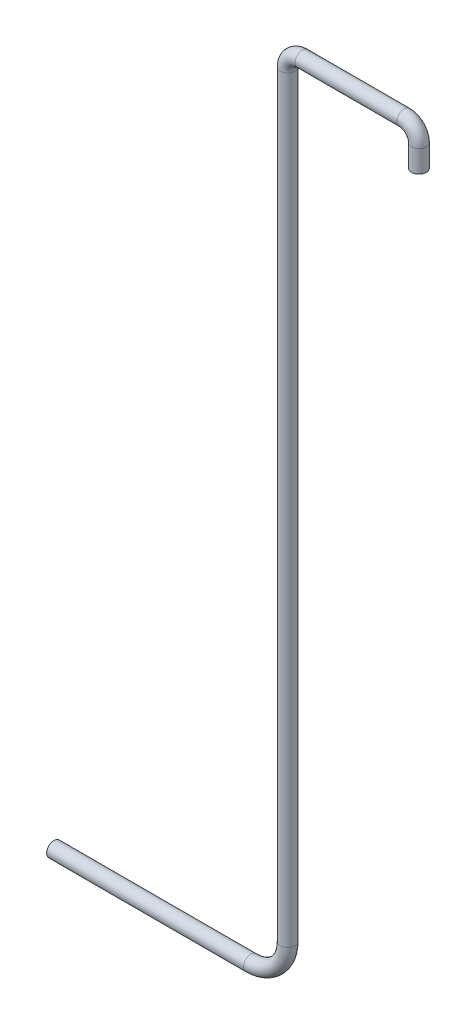
ISO-10303-21;
HEADER;
FILE_DESCRIPTION(('STEP AP214'),'2;1');
FILE_NAME('part.step','',(''),(''),'','','');
FILE_SCHEMA(('AUTOMOTIVE_DESIGN { 1 0 10303 214 1 1 1 1 }'));
ENDSEC;
DATA;
#1=APPLICATION_CONTEXT('core data for automotive mechanical design processes');
#2=APPLICATION_PROTOCOL_DEFINITION('international standard','automotive_design',2000,#1);
#3=PRODUCT_CONTEXT('',#1,'mechanical');
#4=PRODUCT('Part','Part','',(#3));
#5=PRODUCT_RELATED_PRODUCT_CATEGORY('part','',(#4));
#6=PRODUCT_DEFINITION_FORMATION('','',#4);
#7=PRODUCT_DEFINITION_CONTEXT('part definition',#1,'design');
#8=PRODUCT_DEFINITION('design','',#6,#7);
#9=PRODUCT_DEFINITION_SHAPE('','',#8);
#10=(LENGTH_UNIT() NAMED_UNIT(*) SI_UNIT(.MILLI.,.METRE.));
#11=(NAMED_UNIT(*) PLANE_ANGLE_UNIT() SI_UNIT($,.RADIAN.));
#12=(NAMED_UNIT(*) SI_UNIT($,.STERADIAN.) SOLID_ANGLE_UNIT());
#13=UNCERTAINTY_MEASURE_WITH_UNIT(LENGTH_MEASURE(1.E-05),#10,'distance_accuracy_value','');
#14=(GEOMETRIC_REPRESENTATION_CONTEXT(3) GLOBAL_UNCERTAINTY_ASSIGNED_CONTEXT((#13)) GLOBAL_UNIT_ASSIGNED_CONTEXT((#10,
#11,#12)) REPRESENTATION_CONTEXT('',''));
#15=CARTESIAN_POINT('',(0.,0.,0.));
#16=DIRECTION('',(0.,0.,1.));
#17=DIRECTION('',(1.,0.,0.));
#18=AXIS2_PLACEMENT_3D('',#15,#16,#17);
#19=CARTESIAN_POINT('',(-2.28453374132914,-10.4924306069734,0.));
#20=DIRECTION('',(-1.,0.,0.));
#21=DIRECTION('',(0.,0.,1.));
#22=AXIS2_PLACEMENT_3D('',#19,#20,#21);
#23=CYLINDRICAL_SURFACE('',#22,0.1);
#24=CARTESIAN_POINT('',(-2.28453374132914,-10.4924306069734,0.));
#25=DIRECTION('',(-1.,0.,0.));
#26=DIRECTION('',(0.,0.,1.));
#27=AXIS2_PLACEMENT_3D('',#24,#25,#26);
#28=CIRCLE('',#27,0.1);
#29=CARTESIAN_POINT('',(-2.28453374132914,-10.5924306069734,0.));
#30=VERTEX_POINT('',#29);
#31=EDGE_CURVE('E34',#30,#30,#28,.T.);
#32=ORIENTED_EDGE('',*,*,#31,.T.);
#33=EDGE_LOOP('',(#32));
#34=FACE_BOUND('',#33,.T.);
#35=CARTESIAN_POINT('',(-4.96020057499891,-10.4924306069734,0.));
#36=DIRECTION('',(-1.,0.,0.));
#37=DIRECTION('',(0.,0.,1.));
#38=AXIS2_PLACEMENT_3D('',#35,#36,#37);
#39=CIRCLE('',#38,0.1);
#40=CARTESIAN_POINT('',(-4.96020057499891,-10.4924306069734,0.1));
#41=VERTEX_POINT('',#40);
#42=EDGE_CURVE('E10',#41,#41,#39,.T.);
#43=ORIENTED_EDGE('',*,*,#42,.F.);
#44=EDGE_LOOP('',(#43));
#45=FACE_BOUND('',#44,.T.);
#46=ADVANCED_FACE('F28',(#34,#45),#23,.T.);
#47=CARTESIAN_POINT('',(-2.28453374132914,-9.99243060697336,0.));
#48=DIRECTION('',(0.,0.,-1.));
#49=DIRECTION('',(-1.,0.,0.));
#50=AXIS2_PLACEMENT_3D('',#47,#48,#49);
#51=TOROIDAL_SURFACE('',#50,0.5,0.1);
#52=CARTESIAN_POINT('',(-1.78453374132914,-9.99243060697336,0.));
#53=DIRECTION('',(0.,-1.,0.));
#54=DIRECTION('',(0.,0.,1.));
#55=AXIS2_PLACEMENT_3D('',#52,#53,#54);
#56=CIRCLE('',#55,0.1);
#57=CARTESIAN_POINT('',(-1.68453374132914,-9.99243060697336,0.));
#58=VERTEX_POINT('',#57);
#59=EDGE_CURVE('E38',#58,#58,#56,.T.);
#60=CARTESIAN_POINT('',(-2.28453374132914,-9.99243060697336,0.));
#61=DIRECTION('',(0.,0.,-1.));
#62=DIRECTION('',(-1.,0.,0.));
#63=AXIS2_PLACEMENT_3D('',#60,#61,#62);
#64=CIRCLE('',#63,0.6);
#65=EDGE_CURVE('',#58,#30,#64,.T.);
#66=ORIENTED_EDGE('',*,*,#59,.T.);
#67=ORIENTED_EDGE('',*,*,#31,.F.);
#68=ORIENTED_EDGE('',*,*,#65,.T.);
#69=ORIENTED_EDGE('',*,*,#65,.F.);
#70=EDGE_LOOP('',(#66,#68,#67,#69));
#71=FACE_BOUND('',#70,.T.);
#72=ADVANCED_FACE('F78',(#71),#51,.T.);
#73=CARTESIAN_POINT('',(-1.78453374132914,0.3,0.));
#74=DIRECTION('',(0.,-1.,0.));
#75=DIRECTION('',(0.,0.,-1.));
#76=AXIS2_PLACEMENT_3D('',#73,#74,#75);
#77=CYLINDRICAL_SURFACE('',#76,0.1);
#78=CARTESIAN_POINT('',(-1.78453374132914,0.3,0.));
#79=DIRECTION('',(0.,-1.,0.));
#80=DIRECTION('',(0.,0.,1.));
#81=AXIS2_PLACEMENT_3D('',#78,#79,#80);
#82=CIRCLE('',#81,0.1);
#83=CARTESIAN_POINT('',(-1.88453374132914,0.3,0.));
#84=VERTEX_POINT('',#83);
#85=EDGE_CURVE('E42',#84,#84,#82,.T.);
#86=ORIENTED_EDGE('',*,*,#85,.T.);
#87=EDGE_LOOP('',(#86));
#88=FACE_BOUND('',#87,.T.);
#89=ORIENTED_EDGE('',*,*,#59,.F.);
#90=EDGE_LOOP('',(#89));
#91=FACE_BOUND('',#90,.T.);
#92=ADVANCED_FACE('F82',(#88,#91),#77,.T.);
#93=CARTESIAN_POINT('',(-1.58453374132914,0.3,0.));
#94=DIRECTION('',(0.,0.,1.));
#95=DIRECTION('',(1.,0.,0.));
#96=AXIS2_PLACEMENT_3D('',#93,#94,#95);
#97=TOROIDAL_SURFACE('',#96,0.2,0.1);
#98=CARTESIAN_POINT('',(-1.58453374132914,0.5,0.));
#99=DIRECTION('',(-1.,0.,0.));
#100=DIRECTION('',(0.,0.,1.));
#101=AXIS2_PLACEMENT_3D('',#98,#99,#100);
#102=CIRCLE('',#101,0.1);
#103=CARTESIAN_POINT('',(-1.58453374132914,0.6,0.));
#104=VERTEX_POINT('',#103);
#105=EDGE_CURVE('E47',#104,#104,#102,.T.);
#106=CARTESIAN_POINT('',(-1.58453374132914,0.3,0.));
#107=DIRECTION('',(0.,0.,1.));
#108=DIRECTION('',(1.,0.,0.));
#109=AXIS2_PLACEMENT_3D('',#106,#107,#108);
#110=CIRCLE('',#109,0.3);
#111=EDGE_CURVE('',#104,#84,#110,.T.);
#112=ORIENTED_EDGE('',*,*,#105,.T.);
#113=ORIENTED_EDGE('',*,*,#85,.F.);
#114=ORIENTED_EDGE('',*,*,#111,.T.);
#115=ORIENTED_EDGE('',*,*,#111,.F.);
#116=EDGE_LOOP('',(#112,#114,#113,#115));
#117=FACE_BOUND('',#116,.T.);
#118=ADVANCED_FACE('F88',(#117),#97,.T.);
#119=CARTESIAN_POINT('',(-0.200000000000001,0.5,0.));
#120=DIRECTION('',(-1.,0.,0.));
#121=DIRECTION('',(0.,-1.,0.));
#122=AXIS2_PLACEMENT_3D('',#119,#120,#121);
#123=CYLINDRICAL_SURFACE('',#122,0.1);
#124=CARTESIAN_POINT('',(-0.200000000000001,0.5,0.));
#125=DIRECTION('',(-1.,0.,0.));
#126=DIRECTION('',(0.,0.,1.));
#127=AXIS2_PLACEMENT_3D('',#124,#125,#126);
#128=CIRCLE('',#127,0.1);
#129=CARTESIAN_POINT('',(-0.200000000000002,0.6,0.));
#130=VERTEX_POINT('',#129);
#131=EDGE_CURVE('E50',#130,#130,#128,.T.);
#132=ORIENTED_EDGE('',*,*,#131,.T.);
#133=EDGE_LOOP('',(#132));
#134=FACE_BOUND('',#133,.T.);
#135=ORIENTED_EDGE('',*,*,#105,.F.);
#136=EDGE_LOOP('',(#135));
#137=FACE_BOUND('',#136,.T.);
#138=ADVANCED_FACE('F95',(#134,#137),#123,.T.);
#139=CARTESIAN_POINT('',(-0.2,0.3,0.));
#140=DIRECTION('',(0.,0.,1.));
#141=DIRECTION('',(1.,0.,0.));
#142=AXIS2_PLACEMENT_3D('',#139,#140,#141);
#143=TOROIDAL_SURFACE('',#142,0.2,0.1);
#144=CARTESIAN_POINT('',(0.,0.299999999999999,0.));
#145=DIRECTION('',(0.,1.,0.));
#146=DIRECTION('',(0.,0.,1.));
#147=AXIS2_PLACEMENT_3D('',#144,#145,#146);
#148=CIRCLE('',#147,0.1);
#149=CARTESIAN_POINT('',(0.1,0.299999999999998,0.));
#150=VERTEX_POINT('',#149);
#151=EDGE_CURVE('E53',#150,#150,#148,.T.);
#152=CARTESIAN_POINT('',(-0.2,0.3,0.));
#153=DIRECTION('',(0.,0.,1.));
#154=DIRECTION('',(1.,0.,0.));
#155=AXIS2_PLACEMENT_3D('',#152,#153,#154);
#156=CIRCLE('',#155,0.3);
#157=EDGE_CURVE('',#150,#130,#156,.T.);
#158=ORIENTED_EDGE('',*,*,#151,.T.);
#159=ORIENTED_EDGE('',*,*,#131,.F.);
#160=ORIENTED_EDGE('',*,*,#157,.T.);
#161=ORIENTED_EDGE('',*,*,#157,.F.);
#162=EDGE_LOOP('',(#158,#160,#159,#161));
#163=FACE_BOUND('',#162,.T.);
#164=ADVANCED_FACE('F60',(#163),#143,.T.);
#165=CARTESIAN_POINT('',(0.,0.299999999999999,0.));
#166=DIRECTION('',(0.,-1.,0.));
#167=DIRECTION('',(0.,0.,-1.));
#168=AXIS2_PLACEMENT_3D('',#165,#166,#167);
#169=CYLINDRICAL_SURFACE('',#168,0.1);
#170=ORIENTED_EDGE('',*,*,#151,.F.);
#171=EDGE_LOOP('',(#170));
#172=FACE_BOUND('',#171,.T.);
#173=CARTESIAN_POINT('',(0.,0.,0.));
#174=DIRECTION('',(0.,1.,0.));
#175=DIRECTION('',(0.,0.,1.));
#176=AXIS2_PLACEMENT_3D('',#173,#174,#175);
#177=CIRCLE('',#176,0.1);
#178=CARTESIAN_POINT('',(0.,0.,0.1));
#179=VERTEX_POINT('',#178);
#180=EDGE_CURVE('E54',#179,#179,#177,.T.);
#181=ORIENTED_EDGE('',*,*,#180,.T.);
#182=EDGE_LOOP('',(#181));
#183=FACE_BOUND('',#182,.T.);
#184=ADVANCED_FACE('F63',(#172,#183),#169,.T.);
#185=CARTESIAN_POINT('',(-4.96020057499891,-10.4924306069734,0.));
#186=DIRECTION('',(-1.,0.,0.));
#187=DIRECTION('',(0.,0.,1.));
#188=AXIS2_PLACEMENT_3D('',#185,#186,#187);
#189=PLANE('',#188);
#190=ORIENTED_EDGE('',*,*,#42,.T.);
#191=EDGE_LOOP('',(#190));
#192=FACE_BOUND('',#191,.T.);
#193=ADVANCED_FACE('F66',(#192),#189,.T.);
#194=CARTESIAN_POINT('',(0.,0.,0.));
#195=DIRECTION('',(0.,1.,0.));
#196=DIRECTION('',(0.,0.,1.));
#197=AXIS2_PLACEMENT_3D('',#194,#195,#196);
#198=PLANE('',#197);
#199=ORIENTED_EDGE('',*,*,#180,.F.);
#200=EDGE_LOOP('',(#199));
#201=FACE_BOUND('',#200,.T.);
#202=ADVANCED_FACE('F70',(#201),#198,.F.);
#203=CLOSED_SHELL('',(#46,#72,#92,#118,#138,#164,#184,#193,#202));
#204=MANIFOLD_SOLID_BREP('B2',#203);
#205=ADVANCED_BREP_SHAPE_REPRESENTATION('',(#18,#204),#14);
#206=SHAPE_DEFINITION_REPRESENTATION(#9,#205);
ENDSEC;
END-ISO-10303-21;
